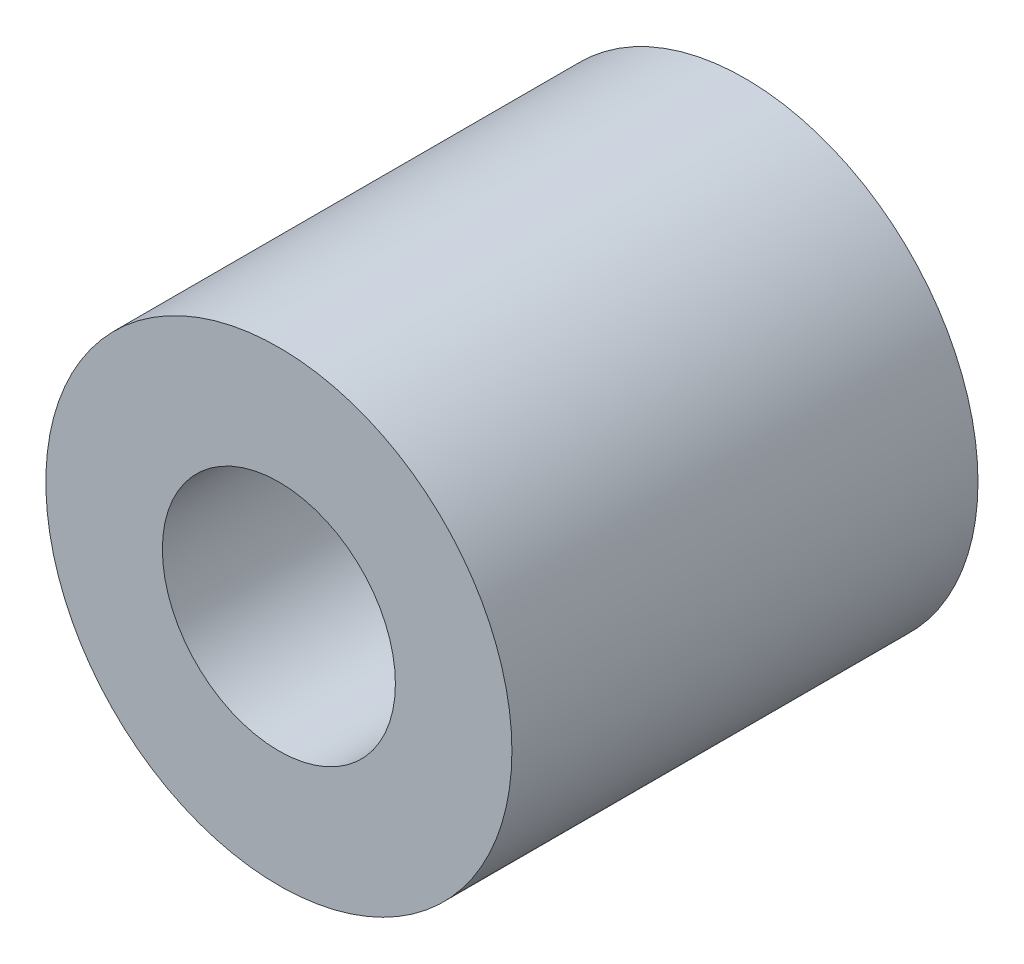
ISO-10303-21;
HEADER;
FILE_DESCRIPTION(('STEP AP214'),'2;1');
FILE_NAME('part.step','',(''),(''),'','','');
FILE_SCHEMA(('AUTOMOTIVE_DESIGN { 1 0 10303 214 1 1 1 1 }'));
ENDSEC;
DATA;
#1=APPLICATION_CONTEXT('core data for automotive mechanical design processes');
#2=APPLICATION_PROTOCOL_DEFINITION('international standard','automotive_design',2000,#1);
#3=PRODUCT_CONTEXT('',#1,'mechanical');
#4=PRODUCT('Part','Part','',(#3));
#5=PRODUCT_RELATED_PRODUCT_CATEGORY('part','',(#4));
#6=PRODUCT_DEFINITION_FORMATION('','',#4);
#7=PRODUCT_DEFINITION_CONTEXT('part definition',#1,'design');
#8=PRODUCT_DEFINITION('design','',#6,#7);
#9=PRODUCT_DEFINITION_SHAPE('','',#8);
#10=(LENGTH_UNIT() NAMED_UNIT(*) SI_UNIT(.MILLI.,.METRE.));
#11=(NAMED_UNIT(*) PLANE_ANGLE_UNIT() SI_UNIT($,.RADIAN.));
#12=(NAMED_UNIT(*) SI_UNIT($,.STERADIAN.) SOLID_ANGLE_UNIT());
#13=UNCERTAINTY_MEASURE_WITH_UNIT(LENGTH_MEASURE(1.E-05),#10,'distance_accuracy_value','');
#14=(GEOMETRIC_REPRESENTATION_CONTEXT(3) GLOBAL_UNCERTAINTY_ASSIGNED_CONTEXT((#13)) GLOBAL_UNIT_ASSIGNED_CONTEXT((#10,
#11,#12)) REPRESENTATION_CONTEXT('',''));
#15=CARTESIAN_POINT('',(0.,0.,0.));
#16=DIRECTION('',(0.,0.,1.));
#17=DIRECTION('',(1.,0.,0.));
#18=AXIS2_PLACEMENT_3D('',#15,#16,#17);
#19=CARTESIAN_POINT('',(0.,0.,6.35));
#20=DIRECTION('',(0.,0.,1.));
#21=DIRECTION('',(1.,0.,0.));
#22=AXIS2_PLACEMENT_3D('',#19,#20,#21);
#23=PLANE('',#22);
#24=CARTESIAN_POINT('',(0.,0.,6.35));
#25=DIRECTION('',(0.,0.,1.));
#26=DIRECTION('',(1.,0.,0.));
#27=AXIS2_PLACEMENT_3D('',#24,#25,#26);
#28=CIRCLE('',#27,3.175);
#29=CARTESIAN_POINT('',(3.175,0.,6.35));
#30=VERTEX_POINT('',#29);
#31=EDGE_CURVE('E10',#30,#30,#28,.T.);
#32=ORIENTED_EDGE('',*,*,#31,.T.);
#33=EDGE_LOOP('',(#32));
#34=FACE_BOUND('',#33,.T.);
#35=CARTESIAN_POINT('',(0.,0.,6.35));
#36=DIRECTION('',(0.,0.,1.));
#37=DIRECTION('',(1.,0.,0.));
#38=AXIS2_PLACEMENT_3D('',#35,#36,#37);
#39=CIRCLE('',#38,1.5875);
#40=CARTESIAN_POINT('',(1.5875,0.,6.35));
#41=VERTEX_POINT('',#40);
#42=EDGE_CURVE('E42',#41,#41,#39,.T.);
#43=ORIENTED_EDGE('',*,*,#42,.F.);
#44=EDGE_LOOP('',(#43));
#45=FACE_BOUND('',#44,.T.);
#46=ADVANCED_FACE('F31',(#34,#45),#23,.T.);
#47=CARTESIAN_POINT('',(0.,0.,0.));
#48=DIRECTION('',(0.,0.,1.));
#49=DIRECTION('',(1.,0.,0.));
#50=AXIS2_PLACEMENT_3D('',#47,#48,#49);
#51=PLANE('',#50);
#52=CARTESIAN_POINT('',(0.,0.,0.));
#53=DIRECTION('',(0.,0.,1.));
#54=DIRECTION('',(1.,0.,0.));
#55=AXIS2_PLACEMENT_3D('',#52,#53,#54);
#56=CIRCLE('',#55,3.175);
#57=CARTESIAN_POINT('',(3.175,0.,0.));
#58=VERTEX_POINT('',#57);
#59=EDGE_CURVE('E35',#58,#58,#56,.T.);
#60=ORIENTED_EDGE('',*,*,#59,.F.);
#61=EDGE_LOOP('',(#60));
#62=FACE_BOUND('',#61,.T.);
#63=CARTESIAN_POINT('',(0.,0.,0.));
#64=DIRECTION('',(0.,0.,1.));
#65=DIRECTION('',(1.,0.,0.));
#66=AXIS2_PLACEMENT_3D('',#63,#64,#65);
#67=CIRCLE('',#66,1.5875);
#68=CARTESIAN_POINT('',(1.5875,0.,0.));
#69=VERTEX_POINT('',#68);
#70=EDGE_CURVE('E44',#69,#69,#67,.T.);
#71=ORIENTED_EDGE('',*,*,#70,.T.);
#72=EDGE_LOOP('',(#71));
#73=FACE_BOUND('',#72,.T.);
#74=ADVANCED_FACE('F54',(#62,#73),#51,.F.);
#75=CARTESIAN_POINT('',(0.,0.,6.35));
#76=DIRECTION('',(0.,0.,-1.));
#77=DIRECTION('',(-1.,0.,0.));
#78=AXIS2_PLACEMENT_3D('',#75,#76,#77);
#79=CYLINDRICAL_SURFACE('',#78,3.175);
#80=ORIENTED_EDGE('',*,*,#31,.F.);
#81=EDGE_LOOP('',(#80));
#82=FACE_BOUND('',#81,.T.);
#83=ORIENTED_EDGE('',*,*,#59,.T.);
#84=EDGE_LOOP('',(#83));
#85=FACE_BOUND('',#84,.T.);
#86=ADVANCED_FACE('F33',(#82,#85),#79,.T.);
#87=CARTESIAN_POINT('',(0.,0.,6.35));
#88=DIRECTION('',(0.,0.,-1.));
#89=DIRECTION('',(-1.,0.,0.));
#90=AXIS2_PLACEMENT_3D('',#87,#88,#89);
#91=CYLINDRICAL_SURFACE('',#90,1.5875);
#92=ORIENTED_EDGE('',*,*,#42,.T.);
#93=EDGE_LOOP('',(#92));
#94=FACE_BOUND('',#93,.T.);
#95=ORIENTED_EDGE('',*,*,#70,.F.);
#96=EDGE_LOOP('',(#95));
#97=FACE_BOUND('',#96,.T.);
#98=ADVANCED_FACE('F50',(#94,#97),#91,.F.);
#99=CLOSED_SHELL('',(#46,#74,#86,#98));
#100=MANIFOLD_SOLID_BREP('B2',#99);
#101=ADVANCED_BREP_SHAPE_REPRESENTATION('',(#18,#100),#14);
#102=SHAPE_DEFINITION_REPRESENTATION(#9,#101);
ENDSEC;
END-ISO-10303-21;
